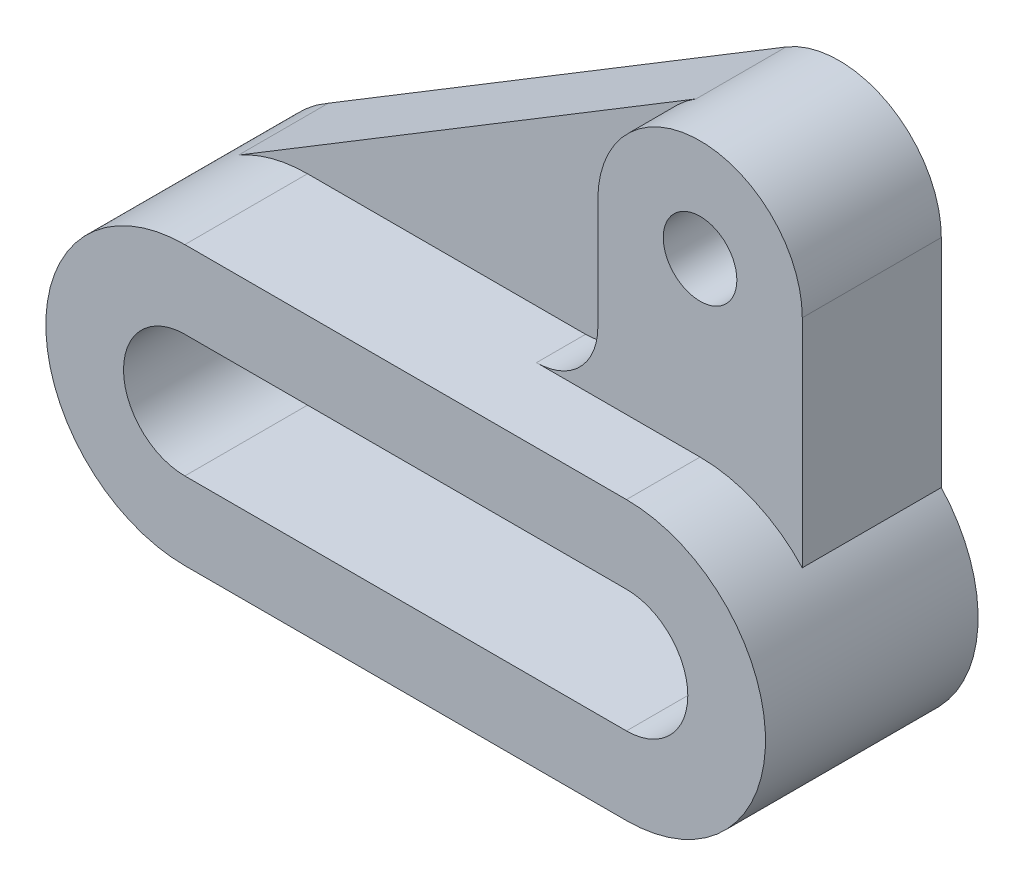
ISO-10303-21;
HEADER;
FILE_DESCRIPTION(('STEP AP214'),'2;1');
FILE_NAME('part.step','',(''),(''),'','','');
FILE_SCHEMA(('AUTOMOTIVE_DESIGN { 1 0 10303 214 1 1 1 1 }'));
ENDSEC;
DATA;
#1=APPLICATION_CONTEXT('core data for automotive mechanical design processes');
#2=APPLICATION_PROTOCOL_DEFINITION('international standard','automotive_design',2000,#1);
#3=PRODUCT_CONTEXT('',#1,'mechanical');
#4=PRODUCT('Part','Part','',(#3));
#5=PRODUCT_RELATED_PRODUCT_CATEGORY('part','',(#4));
#6=PRODUCT_DEFINITION_FORMATION('','',#4);
#7=PRODUCT_DEFINITION_CONTEXT('part definition',#1,'design');
#8=PRODUCT_DEFINITION('design','',#6,#7);
#9=PRODUCT_DEFINITION_SHAPE('','',#8);
#10=(LENGTH_UNIT() NAMED_UNIT(*) SI_UNIT(.MILLI.,.METRE.));
#11=(NAMED_UNIT(*) PLANE_ANGLE_UNIT() SI_UNIT($,.RADIAN.));
#12=(NAMED_UNIT(*) SI_UNIT($,.STERADIAN.) SOLID_ANGLE_UNIT());
#13=UNCERTAINTY_MEASURE_WITH_UNIT(LENGTH_MEASURE(1.E-05),#10,'distance_accuracy_value','');
#14=(GEOMETRIC_REPRESENTATION_CONTEXT(3) GLOBAL_UNCERTAINTY_ASSIGNED_CONTEXT((#13)) GLOBAL_UNIT_ASSIGNED_CONTEXT((#10,
#11,#12)) REPRESENTATION_CONTEXT('',''));
#15=CARTESIAN_POINT('',(0.,0.,0.));
#16=DIRECTION('',(0.,0.,1.));
#17=DIRECTION('',(1.,0.,0.));
#18=AXIS2_PLACEMENT_3D('',#15,#16,#17);
#19=CARTESIAN_POINT('',(0.,0.,52.));
#20=DIRECTION('',(0.,0.,-1.));
#21=DIRECTION('',(-1.,0.,0.));
#22=AXIS2_PLACEMENT_3D('',#19,#20,#21);
#23=CYLINDRICAL_SURFACE('',#22,34.);
#24=DIRECTION('',(0.,0.,-1.));
#25=VECTOR('',#24,1.);
#26=CARTESIAN_POINT('',(-16.891194037702,29.5074154066516,22.));
#27=LINE('',#26,#25);
#28=CARTESIAN_POINT('',(-16.891194037702,29.5074154066516,22.));
#29=VERTEX_POINT('',#28);
#30=CARTESIAN_POINT('',(-16.891194037702,29.5074154066516,0.));
#31=VERTEX_POINT('',#30);
#32=EDGE_CURVE('E53',#29,#31,#27,.T.);
#33=ORIENTED_EDGE('',*,*,#32,.T.);
#34=CARTESIAN_POINT('',(0.,0.,0.));
#35=DIRECTION('',(0.,0.,1.));
#36=DIRECTION('',(1.,0.,0.));
#37=AXIS2_PLACEMENT_3D('',#34,#35,#36);
#38=CIRCLE('',#37,34.);
#39=CARTESIAN_POINT('',(0.,-34.,0.));
#40=VERTEX_POINT('',#39);
#41=EDGE_CURVE('E221',#31,#40,#38,.T.);
#42=ORIENTED_EDGE('',*,*,#41,.T.);
#43=DIRECTION('',(0.,0.,-1.));
#44=VECTOR('',#43,1.);
#45=CARTESIAN_POINT('',(0.,-34.,52.));
#46=LINE('',#45,#44);
#47=CARTESIAN_POINT('',(0.,-34.,52.));
#48=VERTEX_POINT('',#47);
#49=EDGE_CURVE('E11',#48,#40,#46,.T.);
#50=ORIENTED_EDGE('',*,*,#49,.F.);
#51=CARTESIAN_POINT('',(0.,0.,52.));
#52=DIRECTION('',(0.,0.,1.));
#53=DIRECTION('',(1.,0.,0.));
#54=AXIS2_PLACEMENT_3D('',#51,#52,#53);
#55=CIRCLE('',#54,34.);
#56=CARTESIAN_POINT('',(0.,34.,52.));
#57=VERTEX_POINT('',#56);
#58=EDGE_CURVE('E222',#57,#48,#55,.T.);
#59=ORIENTED_EDGE('',*,*,#58,.F.);
#60=DIRECTION('',(0.,0.,-1.));
#61=VECTOR('',#60,1.);
#62=CARTESIAN_POINT('',(0.,34.,52.));
#63=LINE('',#62,#61);
#64=CARTESIAN_POINT('',(0.,34.,22.));
#65=VERTEX_POINT('',#64);
#66=EDGE_CURVE('E232',#57,#65,#63,.T.);
#67=ORIENTED_EDGE('',*,*,#66,.T.);
#68=CARTESIAN_POINT('',(0.,0.,22.));
#69=DIRECTION('',(0.,0.,-1.));
#70=DIRECTION('',(1.,0.,0.));
#71=AXIS2_PLACEMENT_3D('',#68,#69,#70);
#72=CIRCLE('',#71,34.);
#73=EDGE_CURVE('E48',#29,#65,#72,.T.);
#74=ORIENTED_EDGE('',*,*,#73,.F.);
#75=EDGE_LOOP('',(#33,#42,#50,#59,#67,#74));
#76=FACE_BOUND('',#75,.T.);
#77=ADVANCED_FACE('F34',(#76),#23,.T.);
#78=CARTESIAN_POINT('',(108.,76.,34.));
#79=DIRECTION('',(0.,0.,-1.));
#80=DIRECTION('',(-1.,0.,0.));
#81=AXIS2_PLACEMENT_3D('',#78,#79,#80);
#82=CYLINDRICAL_SURFACE('',#81,25.);
#83=DIRECTION('',(0.,0.,-1.));
#84=VECTOR('',#83,1.);
#85=CARTESIAN_POINT('',(95.0377147777406,97.3770709363279,22.));
#86=LINE('',#85,#84);
#87=CARTESIAN_POINT('',(95.0377147777406,97.3770709363279,22.));
#88=VERTEX_POINT('',#87);
#89=CARTESIAN_POINT('',(95.0377147777406,97.3770709363279,0.));
#90=VERTEX_POINT('',#89);
#91=EDGE_CURVE('E275',#88,#90,#86,.T.);
#92=ORIENTED_EDGE('',*,*,#91,.F.);
#93=CARTESIAN_POINT('',(108.,76.,22.));
#94=DIRECTION('',(0.,0.,-1.));
#95=DIRECTION('',(1.,0.,0.));
#96=AXIS2_PLACEMENT_3D('',#93,#94,#95);
#97=CIRCLE('',#96,25.);
#98=CARTESIAN_POINT('',(83.,76.,22.));
#99=VERTEX_POINT('',#98);
#100=EDGE_CURVE('E410',#99,#88,#97,.T.);
#101=ORIENTED_EDGE('',*,*,#100,.F.);
#102=DIRECTION('',(0.,0.,-1.));
#103=VECTOR('',#102,1.);
#104=CARTESIAN_POINT('',(83.,76.,34.));
#105=LINE('',#104,#103);
#106=CARTESIAN_POINT('',(83.,76.,34.));
#107=VERTEX_POINT('',#106);
#108=EDGE_CURVE('E184',#107,#99,#105,.T.);
#109=ORIENTED_EDGE('',*,*,#108,.F.);
#110=CARTESIAN_POINT('',(108.,76.,34.));
#111=DIRECTION('',(0.,0.,1.));
#112=DIRECTION('',(1.,0.,0.));
#113=AXIS2_PLACEMENT_3D('',#110,#111,#112);
#114=CIRCLE('',#113,25.);
#115=CARTESIAN_POINT('',(133.,76.,34.));
#116=VERTEX_POINT('',#115);
#117=EDGE_CURVE('E175',#116,#107,#114,.T.);
#118=ORIENTED_EDGE('',*,*,#117,.F.);
#119=DIRECTION('',(0.,0.,-1.));
#120=VECTOR('',#119,1.);
#121=CARTESIAN_POINT('',(133.,76.,34.));
#122=LINE('',#121,#120);
#123=CARTESIAN_POINT('',(133.,76.,0.));
#124=VERTEX_POINT('',#123);
#125=EDGE_CURVE('E187',#116,#124,#122,.T.);
#126=ORIENTED_EDGE('',*,*,#125,.T.);
#127=CARTESIAN_POINT('',(108.,76.,0.));
#128=DIRECTION('',(0.,0.,1.));
#129=DIRECTION('',(1.,0.,0.));
#130=AXIS2_PLACEMENT_3D('',#127,#128,#129);
#131=CIRCLE('',#130,25.);
#132=EDGE_CURVE('E151',#124,#90,#131,.T.);
#133=ORIENTED_EDGE('',*,*,#132,.T.);
#134=EDGE_LOOP('',(#92,#101,#109,#118,#126,#133));
#135=FACE_BOUND('',#134,.T.);
#136=ADVANCED_FACE('F260',(#135),#82,.T.);
#137=CARTESIAN_POINT('',(0.,0.,52.));
#138=DIRECTION('',(0.,0.,1.));
#139=DIRECTION('',(1.,0.,0.));
#140=AXIS2_PLACEMENT_3D('',#137,#138,#139);
#141=PLANE('',#140);
#142=ORIENTED_EDGE('',*,*,#58,.T.);
#143=DIRECTION('',(1.,0.,0.));
#144=VECTOR('',#143,1.);
#145=CARTESIAN_POINT('',(0.,-34.,52.));
#146=LINE('',#145,#144);
#147=CARTESIAN_POINT('',(108.,-34.,52.));
#148=VERTEX_POINT('',#147);
#149=EDGE_CURVE('E225',#48,#148,#146,.T.);
#150=ORIENTED_EDGE('',*,*,#149,.T.);
#151=CARTESIAN_POINT('',(108.,0.,52.));
#152=DIRECTION('',(0.,0.,1.));
#153=DIRECTION('',(1.,0.,0.));
#154=AXIS2_PLACEMENT_3D('',#151,#152,#153);
#155=CIRCLE('',#154,34.);
#156=CARTESIAN_POINT('',(108.,34.,52.));
#157=VERTEX_POINT('',#156);
#158=EDGE_CURVE('E228',#148,#157,#155,.T.);
#159=ORIENTED_EDGE('',*,*,#158,.T.);
#160=DIRECTION('',(-1.,0.,0.));
#161=VECTOR('',#160,1.);
#162=CARTESIAN_POINT('',(0.,34.,52.));
#163=LINE('',#162,#161);
#164=EDGE_CURVE('E230',#157,#57,#163,.T.);
#165=ORIENTED_EDGE('',*,*,#164,.T.);
#166=EDGE_LOOP('',(#142,#150,#159,#165));
#167=FACE_BOUND('',#166,.T.);
#168=DIRECTION('',(1.,0.,0.));
#169=VECTOR('',#168,1.);
#170=CARTESIAN_POINT('',(0.,-15.,52.));
#171=LINE('',#170,#169);
#172=CARTESIAN_POINT('',(0.,-15.,52.));
#173=VERTEX_POINT('',#172);
#174=CARTESIAN_POINT('',(108.,-15.,52.));
#175=VERTEX_POINT('',#174);
#176=EDGE_CURVE('E193',#173,#175,#171,.T.);
#177=ORIENTED_EDGE('',*,*,#176,.F.);
#178=CARTESIAN_POINT('',(0.,0.,52.));
#179=DIRECTION('',(0.,0.,1.));
#180=DIRECTION('',(1.,0.,0.));
#181=AXIS2_PLACEMENT_3D('',#178,#179,#180);
#182=CIRCLE('',#181,15.);
#183=CARTESIAN_POINT('',(0.,15.,52.));
#184=VERTEX_POINT('',#183);
#185=EDGE_CURVE('E191',#184,#173,#182,.T.);
#186=ORIENTED_EDGE('',*,*,#185,.F.);
#187=DIRECTION('',(-1.,0.,0.));
#188=VECTOR('',#187,1.);
#189=CARTESIAN_POINT('',(0.,15.,52.));
#190=LINE('',#189,#188);
#191=CARTESIAN_POINT('',(108.,15.,52.));
#192=VERTEX_POINT('',#191);
#193=EDGE_CURVE('E199',#192,#184,#190,.T.);
#194=ORIENTED_EDGE('',*,*,#193,.F.);
#195=CARTESIAN_POINT('',(108.,0.,52.));
#196=DIRECTION('',(0.,0.,1.));
#197=DIRECTION('',(1.,0.,0.));
#198=AXIS2_PLACEMENT_3D('',#195,#196,#197);
#199=CIRCLE('',#198,15.);
#200=EDGE_CURVE('E196',#175,#192,#199,.T.);
#201=ORIENTED_EDGE('',*,*,#200,.F.);
#202=EDGE_LOOP('',(#177,#186,#194,#201));
#203=FACE_BOUND('',#202,.T.);
#204=ADVANCED_FACE('F266',(#167,#203),#141,.T.);
#205=CARTESIAN_POINT('',(0.,0.,0.));
#206=DIRECTION('',(0.,0.,1.));
#207=DIRECTION('',(1.,0.,0.));
#208=AXIS2_PLACEMENT_3D('',#205,#206,#207);
#209=PLANE('',#208);
#210=ORIENTED_EDGE('',*,*,#41,.F.);
#211=DIRECTION('',(-0.855082837453117,-0.518491408890376,0.));
#212=VECTOR('',#211,1.);
#213=CARTESIAN_POINT('',(-16.891194037702,29.5074154066516,0.));
#214=LINE('',#213,#212);
#215=EDGE_CURVE('E271',#90,#31,#214,.T.);
#216=ORIENTED_EDGE('',*,*,#215,.F.);
#217=ORIENTED_EDGE('',*,*,#132,.F.);
#218=DIRECTION('',(0.,1.,0.));
#219=VECTOR('',#218,1.);
#220=CARTESIAN_POINT('',(133.,76.,0.));
#221=LINE('',#220,#219);
#222=CARTESIAN_POINT('',(133.,23.0434372436059,0.));
#223=VERTEX_POINT('',#222);
#224=EDGE_CURVE('E179',#223,#124,#221,.T.);
#225=ORIENTED_EDGE('',*,*,#224,.F.);
#226=CARTESIAN_POINT('',(108.,0.,0.));
#227=DIRECTION('',(0.,0.,1.));
#228=DIRECTION('',(1.,0.,0.));
#229=AXIS2_PLACEMENT_3D('',#226,#227,#228);
#230=CIRCLE('',#229,34.);
#231=CARTESIAN_POINT('',(108.,-34.,0.));
#232=VERTEX_POINT('',#231);
#233=EDGE_CURVE('E226',#232,#223,#230,.T.);
#234=ORIENTED_EDGE('',*,*,#233,.F.);
#235=DIRECTION('',(1.,0.,0.));
#236=VECTOR('',#235,1.);
#237=CARTESIAN_POINT('',(0.,-34.,0.));
#238=LINE('',#237,#236);
#239=EDGE_CURVE('E234',#40,#232,#238,.T.);
#240=ORIENTED_EDGE('',*,*,#239,.F.);
#241=EDGE_LOOP('',(#210,#216,#217,#225,#234,#240));
#242=FACE_BOUND('',#241,.T.);
#243=CARTESIAN_POINT('',(0.,0.,0.));
#244=DIRECTION('',(0.,0.,1.));
#245=DIRECTION('',(1.,0.,0.));
#246=AXIS2_PLACEMENT_3D('',#243,#244,#245);
#247=CIRCLE('',#246,15.);
#248=CARTESIAN_POINT('',(0.,15.,0.));
#249=VERTEX_POINT('',#248);
#250=CARTESIAN_POINT('',(0.,-15.,0.));
#251=VERTEX_POINT('',#250);
#252=EDGE_CURVE('E160',#249,#251,#247,.T.);
#253=ORIENTED_EDGE('',*,*,#252,.T.);
#254=DIRECTION('',(1.,0.,0.));
#255=VECTOR('',#254,1.);
#256=CARTESIAN_POINT('',(0.,-15.,0.));
#257=LINE('',#256,#255);
#258=CARTESIAN_POINT('',(108.,-15.,0.));
#259=VERTEX_POINT('',#258);
#260=EDGE_CURVE('E204',#251,#259,#257,.T.);
#261=ORIENTED_EDGE('',*,*,#260,.T.);
#262=CARTESIAN_POINT('',(108.,0.,0.));
#263=DIRECTION('',(0.,0.,1.));
#264=DIRECTION('',(1.,0.,0.));
#265=AXIS2_PLACEMENT_3D('',#262,#263,#264);
#266=CIRCLE('',#265,15.);
#267=CARTESIAN_POINT('',(108.,15.,0.));
#268=VERTEX_POINT('',#267);
#269=EDGE_CURVE('E207',#259,#268,#266,.T.);
#270=ORIENTED_EDGE('',*,*,#269,.T.);
#271=DIRECTION('',(-1.,0.,0.));
#272=VECTOR('',#271,1.);
#273=CARTESIAN_POINT('',(0.,15.,0.));
#274=LINE('',#273,#272);
#275=EDGE_CURVE('E194',#268,#249,#274,.T.);
#276=ORIENTED_EDGE('',*,*,#275,.T.);
#277=EDGE_LOOP('',(#253,#261,#270,#276));
#278=FACE_BOUND('',#277,.T.);
#279=CARTESIAN_POINT('',(108.,76.,0.));
#280=DIRECTION('',(0.,0.,1.));
#281=DIRECTION('',(1.,0.,0.));
#282=AXIS2_PLACEMENT_3D('',#279,#280,#281);
#283=CIRCLE('',#282,8.99999999999999);
#284=CARTESIAN_POINT('',(117.,76.,0.));
#285=VERTEX_POINT('',#284);
#286=EDGE_CURVE('E285',#285,#285,#283,.T.);
#287=ORIENTED_EDGE('',*,*,#286,.T.);
#288=EDGE_LOOP('',(#287));
#289=FACE_BOUND('',#288,.T.);
#290=ADVANCED_FACE('F250',(#242,#278,#289),#209,.F.);
#291=CARTESIAN_POINT('',(0.,-34.,52.));
#292=DIRECTION('',(0.,1.,0.));
#293=DIRECTION('',(-1.,0.,0.));
#294=AXIS2_PLACEMENT_3D('',#291,#292,#293);
#295=PLANE('',#294);
#296=ORIENTED_EDGE('',*,*,#239,.T.);
#297=DIRECTION('',(0.,0.,-1.));
#298=VECTOR('',#297,1.);
#299=CARTESIAN_POINT('',(108.,-34.,52.));
#300=LINE('',#299,#298);
#301=EDGE_CURVE('E41',#148,#232,#300,.T.);
#302=ORIENTED_EDGE('',*,*,#301,.F.);
#303=ORIENTED_EDGE('',*,*,#149,.F.);
#304=ORIENTED_EDGE('',*,*,#49,.T.);
#305=EDGE_LOOP('',(#296,#302,#303,#304));
#306=FACE_BOUND('',#305,.T.);
#307=ADVANCED_FACE('F269',(#306),#295,.F.);
#308=CARTESIAN_POINT('',(108.,0.,52.));
#309=DIRECTION('',(0.,0.,-1.));
#310=DIRECTION('',(-1.,0.,0.));
#311=AXIS2_PLACEMENT_3D('',#308,#309,#310);
#312=CYLINDRICAL_SURFACE('',#311,34.);
#313=DIRECTION('',(0.,0.,-1.));
#314=VECTOR('',#313,1.);
#315=CARTESIAN_POINT('',(133.,23.0434372436059,34.));
#316=LINE('',#315,#314);
#317=CARTESIAN_POINT('',(133.,23.0434372436059,34.));
#318=VERTEX_POINT('',#317);
#319=EDGE_CURVE('E161',#318,#223,#316,.T.);
#320=ORIENTED_EDGE('',*,*,#319,.F.);
#321=CARTESIAN_POINT('',(108.,0.,34.));
#322=DIRECTION('',(0.,0.,-1.));
#323=DIRECTION('',(1.,0.,0.));
#324=AXIS2_PLACEMENT_3D('',#321,#322,#323);
#325=CIRCLE('',#324,34.);
#326=CARTESIAN_POINT('',(108.,34.,34.));
#327=VERTEX_POINT('',#326);
#328=EDGE_CURVE('E168',#327,#318,#325,.T.);
#329=ORIENTED_EDGE('',*,*,#328,.F.);
#330=DIRECTION('',(0.,0.,-1.));
#331=VECTOR('',#330,1.);
#332=CARTESIAN_POINT('',(108.,34.,52.));
#333=LINE('',#332,#331);
#334=EDGE_CURVE('E167',#157,#327,#333,.T.);
#335=ORIENTED_EDGE('',*,*,#334,.F.);
#336=ORIENTED_EDGE('',*,*,#158,.F.);
#337=ORIENTED_EDGE('',*,*,#301,.T.);
#338=ORIENTED_EDGE('',*,*,#233,.T.);
#339=EDGE_LOOP('',(#320,#329,#335,#336,#337,#338));
#340=FACE_BOUND('',#339,.T.);
#341=ADVANCED_FACE('F245',(#340),#312,.T.);
#342=CARTESIAN_POINT('',(0.,34.,52.));
#343=DIRECTION('',(0.,-1.,0.));
#344=DIRECTION('',(1.,0.,0.));
#345=AXIS2_PLACEMENT_3D('',#342,#343,#344);
#346=PLANE('',#345);
#347=DIRECTION('',(0.,0.,-1.));
#348=VECTOR('',#347,1.);
#349=CARTESIAN_POINT('',(67.9999999999999,34.,34.));
#350=LINE('',#349,#348);
#351=CARTESIAN_POINT('',(67.9999999999999,34.,34.));
#352=VERTEX_POINT('',#351);
#353=CARTESIAN_POINT('',(67.9999999999999,34.,22.));
#354=VERTEX_POINT('',#353);
#355=EDGE_CURVE('E154',#352,#354,#350,.T.);
#356=ORIENTED_EDGE('',*,*,#355,.T.);
#357=DIRECTION('',(1.,0.,0.));
#358=VECTOR('',#357,1.);
#359=CARTESIAN_POINT('',(67.9999999999999,34.,22.));
#360=LINE('',#359,#358);
#361=EDGE_CURVE('E277',#65,#354,#360,.T.);
#362=ORIENTED_EDGE('',*,*,#361,.F.);
#363=ORIENTED_EDGE('',*,*,#66,.F.);
#364=ORIENTED_EDGE('',*,*,#164,.F.);
#365=ORIENTED_EDGE('',*,*,#334,.T.);
#366=DIRECTION('',(1.,0.,0.));
#367=VECTOR('',#366,1.);
#368=CARTESIAN_POINT('',(108.,34.,34.));
#369=LINE('',#368,#367);
#370=EDGE_CURVE('E144',#352,#327,#369,.T.);
#371=ORIENTED_EDGE('',*,*,#370,.F.);
#372=EDGE_LOOP('',(#356,#362,#363,#364,#365,#371));
#373=FACE_BOUND('',#372,.T.);
#374=ADVANCED_FACE('F164',(#373),#346,.F.);
#375=CARTESIAN_POINT('',(0.,0.,52.));
#376=DIRECTION('',(0.,0.,-1.));
#377=DIRECTION('',(-1.,0.,0.));
#378=AXIS2_PLACEMENT_3D('',#375,#376,#377);
#379=CYLINDRICAL_SURFACE('',#378,15.);
#380=ORIENTED_EDGE('',*,*,#252,.F.);
#381=DIRECTION('',(0.,0.,-1.));
#382=VECTOR('',#381,1.);
#383=CARTESIAN_POINT('',(0.,15.,52.));
#384=LINE('',#383,#382);
#385=EDGE_CURVE('E201',#184,#249,#384,.T.);
#386=ORIENTED_EDGE('',*,*,#385,.F.);
#387=ORIENTED_EDGE('',*,*,#185,.T.);
#388=DIRECTION('',(0.,0.,-1.));
#389=VECTOR('',#388,1.);
#390=CARTESIAN_POINT('',(0.,-15.,52.));
#391=LINE('',#390,#389);
#392=EDGE_CURVE('E218',#173,#251,#391,.T.);
#393=ORIENTED_EDGE('',*,*,#392,.T.);
#394=EDGE_LOOP('',(#380,#386,#387,#393));
#395=FACE_BOUND('',#394,.T.);
#396=ADVANCED_FACE('F330',(#395),#379,.F.);
#397=CARTESIAN_POINT('',(0.,-15.,52.));
#398=DIRECTION('',(0.,1.,0.));
#399=DIRECTION('',(0.,0.,1.));
#400=AXIS2_PLACEMENT_3D('',#397,#398,#399);
#401=PLANE('',#400);
#402=ORIENTED_EDGE('',*,*,#260,.F.);
#403=ORIENTED_EDGE('',*,*,#392,.F.);
#404=ORIENTED_EDGE('',*,*,#176,.T.);
#405=DIRECTION('',(0.,0.,-1.));
#406=VECTOR('',#405,1.);
#407=CARTESIAN_POINT('',(108.,-15.,52.));
#408=LINE('',#407,#406);
#409=EDGE_CURVE('E216',#175,#259,#408,.T.);
#410=ORIENTED_EDGE('',*,*,#409,.T.);
#411=EDGE_LOOP('',(#402,#403,#404,#410));
#412=FACE_BOUND('',#411,.T.);
#413=ADVANCED_FACE('F326',(#412),#401,.T.);
#414=CARTESIAN_POINT('',(108.,0.,52.));
#415=DIRECTION('',(0.,0.,-1.));
#416=DIRECTION('',(-1.,0.,0.));
#417=AXIS2_PLACEMENT_3D('',#414,#415,#416);
#418=CYLINDRICAL_SURFACE('',#417,15.);
#419=ORIENTED_EDGE('',*,*,#269,.F.);
#420=ORIENTED_EDGE('',*,*,#409,.F.);
#421=ORIENTED_EDGE('',*,*,#200,.T.);
#422=DIRECTION('',(0.,0.,-1.));
#423=VECTOR('',#422,1.);
#424=CARTESIAN_POINT('',(108.,15.,52.));
#425=LINE('',#424,#423);
#426=EDGE_CURVE('E214',#192,#268,#425,.T.);
#427=ORIENTED_EDGE('',*,*,#426,.T.);
#428=EDGE_LOOP('',(#419,#420,#421,#427));
#429=FACE_BOUND('',#428,.T.);
#430=ADVANCED_FACE('F322',(#429),#418,.F.);
#431=CARTESIAN_POINT('',(0.,15.,52.));
#432=DIRECTION('',(0.,-1.,0.));
#433=DIRECTION('',(0.,0.,-1.));
#434=AXIS2_PLACEMENT_3D('',#431,#432,#433);
#435=PLANE('',#434);
#436=ORIENTED_EDGE('',*,*,#275,.F.);
#437=ORIENTED_EDGE('',*,*,#426,.F.);
#438=ORIENTED_EDGE('',*,*,#193,.T.);
#439=ORIENTED_EDGE('',*,*,#385,.T.);
#440=EDGE_LOOP('',(#436,#437,#438,#439));
#441=FACE_BOUND('',#440,.T.);
#442=ADVANCED_FACE('F319',(#441),#435,.T.);
#443=CARTESIAN_POINT('',(68.,49.,34.));
#444=DIRECTION('',(0.,0.,1.));
#445=DIRECTION('',(1.,0.,0.));
#446=AXIS2_PLACEMENT_3D('',#443,#444,#445);
#447=PLANE('',#446);
#448=CARTESIAN_POINT('',(68.,49.,34.));
#449=DIRECTION('',(0.,0.,-1.));
#450=DIRECTION('',(1.,0.,0.));
#451=AXIS2_PLACEMENT_3D('',#448,#449,#450);
#452=CIRCLE('',#451,15.);
#453=CARTESIAN_POINT('',(83.,49.0000000000001,34.));
#454=VERTEX_POINT('',#453);
#455=EDGE_CURVE('E139',#454,#352,#452,.T.);
#456=ORIENTED_EDGE('',*,*,#455,.T.);
#457=ORIENTED_EDGE('',*,*,#370,.T.);
#458=ORIENTED_EDGE('',*,*,#328,.T.);
#459=DIRECTION('',(0.,1.,0.));
#460=VECTOR('',#459,1.);
#461=CARTESIAN_POINT('',(133.,76.,34.));
#462=LINE('',#461,#460);
#463=EDGE_CURVE('E170',#318,#116,#462,.T.);
#464=ORIENTED_EDGE('',*,*,#463,.T.);
#465=ORIENTED_EDGE('',*,*,#117,.T.);
#466=DIRECTION('',(0.,-1.,0.));
#467=VECTOR('',#466,1.);
#468=CARTESIAN_POINT('',(83.,76.,34.));
#469=LINE('',#468,#467);
#470=EDGE_CURVE('E147',#107,#454,#469,.T.);
#471=ORIENTED_EDGE('',*,*,#470,.T.);
#472=EDGE_LOOP('',(#456,#457,#458,#464,#465,#471));
#473=FACE_BOUND('',#472,.T.);
#474=CARTESIAN_POINT('',(108.,76.,34.));
#475=DIRECTION('',(0.,0.,1.));
#476=DIRECTION('',(1.,0.,0.));
#477=AXIS2_PLACEMENT_3D('',#474,#475,#476);
#478=CIRCLE('',#477,8.99999999999999);
#479=CARTESIAN_POINT('',(117.,76.,34.));
#480=VERTEX_POINT('',#479);
#481=EDGE_CURVE('E181',#480,#480,#478,.T.);
#482=ORIENTED_EDGE('',*,*,#481,.F.);
#483=EDGE_LOOP('',(#482));
#484=FACE_BOUND('',#483,.T.);
#485=ADVANCED_FACE('F141',(#473,#484),#447,.T.);
#486=CARTESIAN_POINT('',(68.,49.,34.));
#487=DIRECTION('',(0.,0.,-1.));
#488=DIRECTION('',(-1.,0.,0.));
#489=AXIS2_PLACEMENT_3D('',#486,#487,#488);
#490=CYLINDRICAL_SURFACE('',#489,15.);
#491=DIRECTION('',(0.,0.,-1.));
#492=VECTOR('',#491,1.);
#493=CARTESIAN_POINT('',(83.,49.0000000000001,34.));
#494=LINE('',#493,#492);
#495=CARTESIAN_POINT('',(83.,49.0000000000001,22.));
#496=VERTEX_POINT('',#495);
#497=EDGE_CURVE('E178',#454,#496,#494,.T.);
#498=ORIENTED_EDGE('',*,*,#497,.T.);
#499=CARTESIAN_POINT('',(68.,49.,22.));
#500=DIRECTION('',(0.,0.,1.));
#501=DIRECTION('',(1.,0.,0.));
#502=AXIS2_PLACEMENT_3D('',#499,#500,#501);
#503=CIRCLE('',#502,15.);
#504=EDGE_CURVE('E157',#354,#496,#503,.T.);
#505=ORIENTED_EDGE('',*,*,#504,.F.);
#506=ORIENTED_EDGE('',*,*,#355,.F.);
#507=ORIENTED_EDGE('',*,*,#455,.F.);
#508=EDGE_LOOP('',(#498,#505,#506,#507));
#509=FACE_BOUND('',#508,.T.);
#510=ADVANCED_FACE('F155',(#509),#490,.F.);
#511=CARTESIAN_POINT('',(133.,76.,34.));
#512=DIRECTION('',(-1.,0.,0.));
#513=DIRECTION('',(0.,0.,1.));
#514=AXIS2_PLACEMENT_3D('',#511,#512,#513);
#515=PLANE('',#514);
#516=ORIENTED_EDGE('',*,*,#224,.T.);
#517=ORIENTED_EDGE('',*,*,#125,.F.);
#518=ORIENTED_EDGE('',*,*,#463,.F.);
#519=ORIENTED_EDGE('',*,*,#319,.T.);
#520=EDGE_LOOP('',(#516,#517,#518,#519));
#521=FACE_BOUND('',#520,.T.);
#522=ADVANCED_FACE('F256',(#521),#515,.F.);
#523=CARTESIAN_POINT('',(83.,76.,34.));
#524=DIRECTION('',(1.,0.,0.));
#525=DIRECTION('',(0.,0.,-1.));
#526=AXIS2_PLACEMENT_3D('',#523,#524,#525);
#527=PLANE('',#526);
#528=ORIENTED_EDGE('',*,*,#108,.T.);
#529=DIRECTION('',(0.,1.,0.));
#530=VECTOR('',#529,1.);
#531=CARTESIAN_POINT('',(83.,76.,22.));
#532=LINE('',#531,#530);
#533=EDGE_CURVE('E411',#496,#99,#532,.T.);
#534=ORIENTED_EDGE('',*,*,#533,.F.);
#535=ORIENTED_EDGE('',*,*,#497,.F.);
#536=ORIENTED_EDGE('',*,*,#470,.F.);
#537=EDGE_LOOP('',(#528,#534,#535,#536));
#538=FACE_BOUND('',#537,.T.);
#539=ADVANCED_FACE('F293',(#538),#527,.F.);
#540=CARTESIAN_POINT('',(108.,76.,34.));
#541=DIRECTION('',(0.,0.,-1.));
#542=DIRECTION('',(-1.,0.,0.));
#543=AXIS2_PLACEMENT_3D('',#540,#541,#542);
#544=CYLINDRICAL_SURFACE('',#543,8.99999999999999);
#545=ORIENTED_EDGE('',*,*,#481,.T.);
#546=EDGE_LOOP('',(#545));
#547=FACE_BOUND('',#546,.T.);
#548=ORIENTED_EDGE('',*,*,#286,.F.);
#549=EDGE_LOOP('',(#548));
#550=FACE_BOUND('',#549,.T.);
#551=ADVANCED_FACE('F291',(#547,#550),#544,.F.);
#552=CARTESIAN_POINT('',(-16.891194037702,29.5074154066516,22.));
#553=DIRECTION('',(0.518491408890376,-0.855082837453117,0.));
#554=DIRECTION('',(0.855082837453117,0.518491408890376,0.));
#555=AXIS2_PLACEMENT_3D('',#552,#553,#554);
#556=PLANE('',#555);
#557=ORIENTED_EDGE('',*,*,#215,.T.);
#558=ORIENTED_EDGE('',*,*,#32,.F.);
#559=DIRECTION('',(-0.855082837453117,-0.518491408890376,0.));
#560=VECTOR('',#559,1.);
#561=CARTESIAN_POINT('',(-16.891194037702,29.5074154066516,22.));
#562=LINE('',#561,#560);
#563=EDGE_CURVE('E281',#88,#29,#562,.T.);
#564=ORIENTED_EDGE('',*,*,#563,.F.);
#565=ORIENTED_EDGE('',*,*,#91,.T.);
#566=EDGE_LOOP('',(#557,#558,#564,#565));
#567=FACE_BOUND('',#566,.T.);
#568=ADVANCED_FACE('F273',(#567),#556,.F.);
#569=CARTESIAN_POINT('',(0.,0.,22.));
#570=DIRECTION('',(0.,0.,1.));
#571=DIRECTION('',(1.,0.,0.));
#572=AXIS2_PLACEMENT_3D('',#569,#570,#571);
#573=PLANE('',#572);
#574=ORIENTED_EDGE('',*,*,#73,.T.);
#575=ORIENTED_EDGE('',*,*,#361,.T.);
#576=ORIENTED_EDGE('',*,*,#504,.T.);
#577=ORIENTED_EDGE('',*,*,#533,.T.);
#578=ORIENTED_EDGE('',*,*,#100,.T.);
#579=ORIENTED_EDGE('',*,*,#563,.T.);
#580=EDGE_LOOP('',(#574,#575,#576,#577,#578,#579));
#581=FACE_BOUND('',#580,.T.);
#582=ADVANCED_FACE('F300',(#581),#573,.T.);
#583=CLOSED_SHELL('',(#77,#136,#204,#290,#307,#341,#374,#396,#413,#430,#442,#485,#510,#522,#539,
#551,#568,#582));
#584=MANIFOLD_SOLID_BREP('B2',#583);
#585=ADVANCED_BREP_SHAPE_REPRESENTATION('',(#18,#584),#14);
#586=SHAPE_DEFINITION_REPRESENTATION(#9,#585);
ENDSEC;
END-ISO-10303-21;
